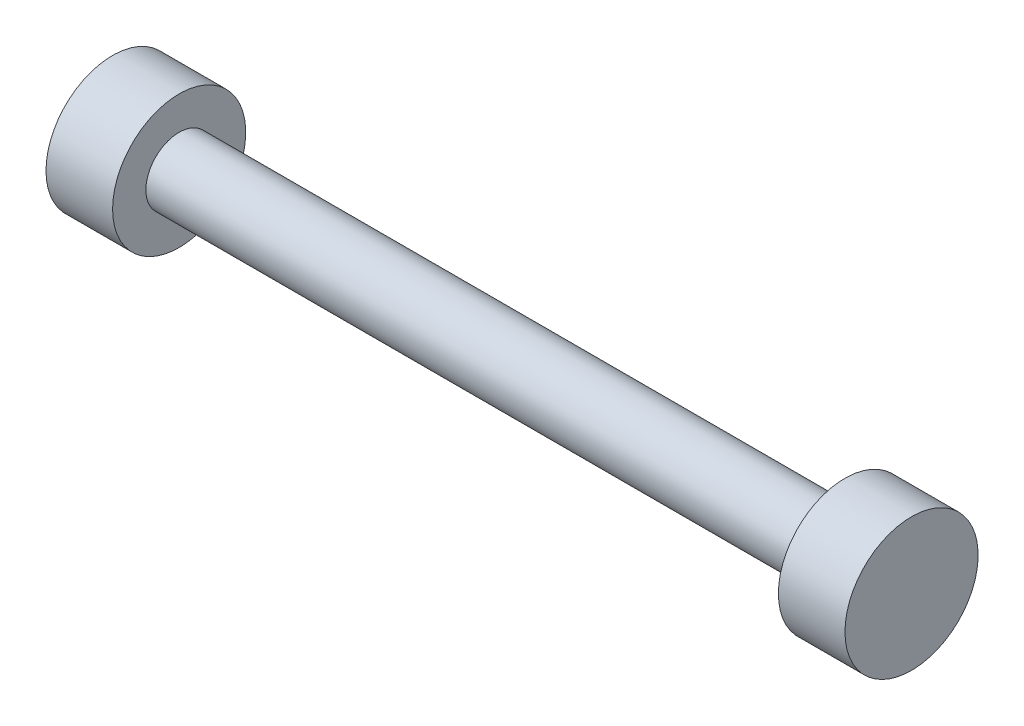
ISO-10303-21;
HEADER;
FILE_DESCRIPTION(('STEP AP214'),'2;1');
FILE_NAME('part.step','',(''),(''),'','','');
FILE_SCHEMA(('AUTOMOTIVE_DESIGN { 1 0 10303 214 1 1 1 1 }'));
ENDSEC;
DATA;
#1=APPLICATION_CONTEXT('core data for automotive mechanical design processes');
#2=APPLICATION_PROTOCOL_DEFINITION('international standard','automotive_design',2000,#1);
#3=PRODUCT_CONTEXT('',#1,'mechanical');
#4=PRODUCT('Part','Part','',(#3));
#5=PRODUCT_RELATED_PRODUCT_CATEGORY('part','',(#4));
#6=PRODUCT_DEFINITION_FORMATION('','',#4);
#7=PRODUCT_DEFINITION_CONTEXT('part definition',#1,'design');
#8=PRODUCT_DEFINITION('design','',#6,#7);
#9=PRODUCT_DEFINITION_SHAPE('','',#8);
#10=(LENGTH_UNIT() NAMED_UNIT(*) SI_UNIT(.MILLI.,.METRE.));
#11=(NAMED_UNIT(*) PLANE_ANGLE_UNIT() SI_UNIT($,.RADIAN.));
#12=(NAMED_UNIT(*) SI_UNIT($,.STERADIAN.) SOLID_ANGLE_UNIT());
#13=UNCERTAINTY_MEASURE_WITH_UNIT(LENGTH_MEASURE(1.E-05),#10,'distance_accuracy_value','');
#14=(GEOMETRIC_REPRESENTATION_CONTEXT(3) GLOBAL_UNCERTAINTY_ASSIGNED_CONTEXT((#13)) GLOBAL_UNIT_ASSIGNED_CONTEXT((#10,
#11,#12)) REPRESENTATION_CONTEXT('',''));
#15=CARTESIAN_POINT('',(0.,0.,0.));
#16=DIRECTION('',(0.,0.,1.));
#17=DIRECTION('',(1.,0.,0.));
#18=AXIS2_PLACEMENT_3D('',#15,#16,#17);
#19=CARTESIAN_POINT('',(-39.5020185079272,0.,0.));
#20=DIRECTION('',(-1.,0.,0.));
#21=DIRECTION('',(0.,0.,1.));
#22=AXIS2_PLACEMENT_3D('',#19,#20,#21);
#23=CYLINDRICAL_SURFACE('',#22,2.5);
#24=CARTESIAN_POINT('',(-25.,0.,0.));
#25=DIRECTION('',(-1.,0.,0.));
#26=DIRECTION('',(0.,0.,1.));
#27=AXIS2_PLACEMENT_3D('',#24,#25,#26);
#28=CIRCLE('',#27,2.49999999999999);
#29=CARTESIAN_POINT('',(-25.,0.,2.49999999999998));
#30=VERTEX_POINT('',#29);
#31=EDGE_CURVE('E10',#30,#30,#28,.T.);
#32=ORIENTED_EDGE('',*,*,#31,.F.);
#33=EDGE_LOOP('',(#32));
#34=FACE_BOUND('',#33,.T.);
#35=CARTESIAN_POINT('',(25.,0.,0.));
#36=DIRECTION('',(-1.,0.,0.));
#37=DIRECTION('',(0.,0.,1.));
#38=AXIS2_PLACEMENT_3D('',#35,#36,#37);
#39=CIRCLE('',#38,2.5);
#40=CARTESIAN_POINT('',(25.,0.,2.5));
#41=VERTEX_POINT('',#40);
#42=EDGE_CURVE('E53',#41,#41,#39,.T.);
#43=ORIENTED_EDGE('',*,*,#42,.T.);
#44=EDGE_LOOP('',(#43));
#45=FACE_BOUND('',#44,.T.);
#46=ADVANCED_FACE('F31',(#34,#45),#23,.T.);
#47=CARTESIAN_POINT('',(-25.,0.,-2.5));
#48=DIRECTION('',(-1.,0.,0.));
#49=DIRECTION('',(0.,0.,1.));
#50=AXIS2_PLACEMENT_3D('',#47,#48,#49);
#51=PLANE('',#50);
#52=CARTESIAN_POINT('',(-25.,0.,0.));
#53=DIRECTION('',(-1.,0.,0.));
#54=DIRECTION('',(0.,0.,1.));
#55=AXIS2_PLACEMENT_3D('',#52,#53,#54);
#56=CIRCLE('',#55,4.99999999999999);
#57=CARTESIAN_POINT('',(-25.,0.,4.99999999999997));
#58=VERTEX_POINT('',#57);
#59=EDGE_CURVE('E37',#58,#58,#56,.T.);
#60=ORIENTED_EDGE('',*,*,#59,.F.);
#61=EDGE_LOOP('',(#60));
#62=FACE_BOUND('',#61,.T.);
#63=ORIENTED_EDGE('',*,*,#31,.T.);
#64=EDGE_LOOP('',(#63));
#65=FACE_BOUND('',#64,.T.);
#66=ADVANCED_FACE('F81',(#62,#65),#51,.F.);
#67=CARTESIAN_POINT('',(-39.5020185079272,0.,0.));
#68=DIRECTION('',(-1.,0.,0.));
#69=DIRECTION('',(0.,0.,1.));
#70=AXIS2_PLACEMENT_3D('',#67,#68,#69);
#71=CYLINDRICAL_SURFACE('',#70,4.99999999999999);
#72=CARTESIAN_POINT('',(-30.,0.,0.));
#73=DIRECTION('',(-1.,0.,0.));
#74=DIRECTION('',(0.,0.,1.));
#75=AXIS2_PLACEMENT_3D('',#72,#73,#74);
#76=CIRCLE('',#75,4.99999999999999);
#77=CARTESIAN_POINT('',(-30.,0.,4.99999999999997));
#78=VERTEX_POINT('',#77);
#79=EDGE_CURVE('E41',#78,#78,#76,.T.);
#80=ORIENTED_EDGE('',*,*,#79,.F.);
#81=EDGE_LOOP('',(#80));
#82=FACE_BOUND('',#81,.T.);
#83=ORIENTED_EDGE('',*,*,#59,.T.);
#84=EDGE_LOOP('',(#83));
#85=FACE_BOUND('',#84,.T.);
#86=ADVANCED_FACE('F77',(#82,#85),#71,.T.);
#87=CARTESIAN_POINT('',(-30.,0.,0.));
#88=DIRECTION('',(1.,0.,0.));
#89=DIRECTION('',(0.,0.,-1.));
#90=AXIS2_PLACEMENT_3D('',#87,#88,#89);
#91=PLANE('',#90);
#92=ORIENTED_EDGE('',*,*,#79,.T.);
#93=EDGE_LOOP('',(#92));
#94=FACE_BOUND('',#93,.T.);
#95=ADVANCED_FACE('F72',(#94),#91,.F.);
#96=CARTESIAN_POINT('',(30.,0.,0.));
#97=DIRECTION('',(-1.,0.,0.));
#98=DIRECTION('',(0.,0.,1.));
#99=AXIS2_PLACEMENT_3D('',#96,#97,#98);
#100=PLANE('',#99);
#101=CARTESIAN_POINT('',(30.,0.,0.));
#102=DIRECTION('',(-1.,0.,0.));
#103=DIRECTION('',(0.,0.,1.));
#104=AXIS2_PLACEMENT_3D('',#101,#102,#103);
#105=CIRCLE('',#104,5.00000000000001);
#106=CARTESIAN_POINT('',(30.,0.,5.));
#107=VERTEX_POINT('',#106);
#108=EDGE_CURVE('E45',#107,#107,#105,.T.);
#109=ORIENTED_EDGE('',*,*,#108,.F.);
#110=EDGE_LOOP('',(#109));
#111=FACE_BOUND('',#110,.T.);
#112=ADVANCED_FACE('F67',(#111),#100,.F.);
#113=CARTESIAN_POINT('',(-39.5020185079272,0.,0.));
#114=DIRECTION('',(-1.,0.,0.));
#115=DIRECTION('',(0.,0.,1.));
#116=AXIS2_PLACEMENT_3D('',#113,#114,#115);
#117=CYLINDRICAL_SURFACE('',#116,5.);
#118=CARTESIAN_POINT('',(25.,0.,0.));
#119=DIRECTION('',(-1.,0.,0.));
#120=DIRECTION('',(0.,0.,1.));
#121=AXIS2_PLACEMENT_3D('',#118,#119,#120);
#122=CIRCLE('',#121,5.);
#123=CARTESIAN_POINT('',(25.,0.,5.));
#124=VERTEX_POINT('',#123);
#125=EDGE_CURVE('E50',#124,#124,#122,.T.);
#126=ORIENTED_EDGE('',*,*,#125,.F.);
#127=EDGE_LOOP('',(#126));
#128=FACE_BOUND('',#127,.T.);
#129=ORIENTED_EDGE('',*,*,#108,.T.);
#130=EDGE_LOOP('',(#129));
#131=FACE_BOUND('',#130,.T.);
#132=ADVANCED_FACE('F61',(#128,#131),#117,.T.);
#133=CARTESIAN_POINT('',(25.,0.,-2.50000000000001));
#134=DIRECTION('',(1.,0.,0.));
#135=DIRECTION('',(0.,0.,-1.));
#136=AXIS2_PLACEMENT_3D('',#133,#134,#135);
#137=PLANE('',#136);
#138=ORIENTED_EDGE('',*,*,#42,.F.);
#139=EDGE_LOOP('',(#138));
#140=FACE_BOUND('',#139,.T.);
#141=ORIENTED_EDGE('',*,*,#125,.T.);
#142=EDGE_LOOP('',(#141));
#143=FACE_BOUND('',#142,.T.);
#144=ADVANCED_FACE('F58',(#140,#143),#137,.F.);
#145=CLOSED_SHELL('',(#46,#66,#86,#95,#112,#132,#144));
#146=MANIFOLD_SOLID_BREP('B2',#145);
#147=ADVANCED_BREP_SHAPE_REPRESENTATION('',(#18,#146),#14);
#148=SHAPE_DEFINITION_REPRESENTATION(#9,#147);
ENDSEC;
END-ISO-10303-21;
